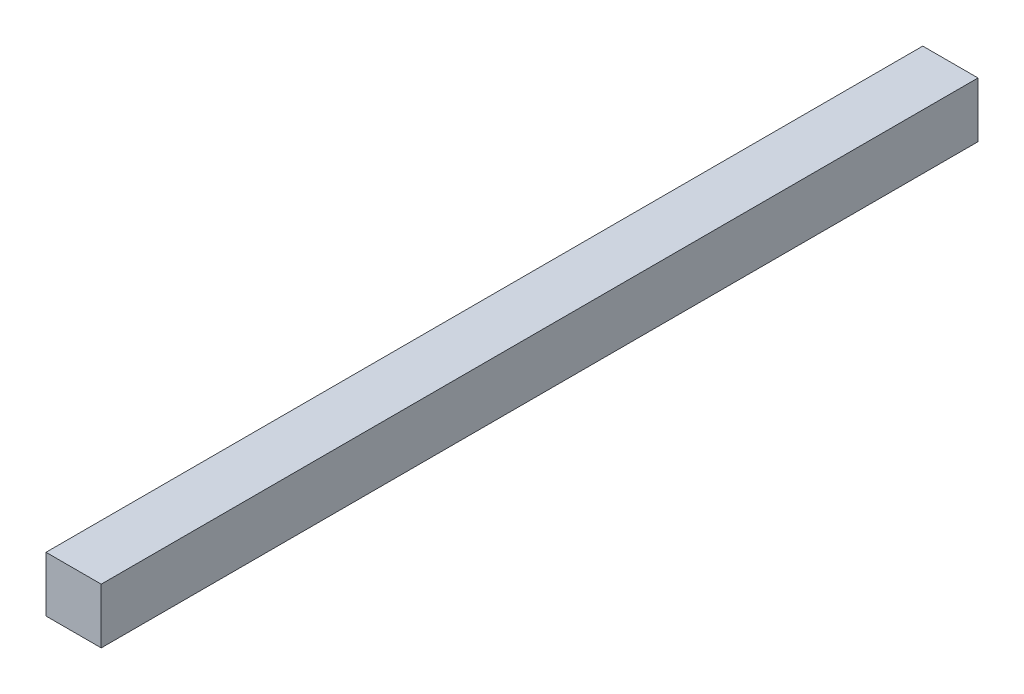
ISO-10303-21;
HEADER;
FILE_DESCRIPTION(('STEP AP214'),'2;1');
FILE_NAME('part.step','',(''),(''),'','','');
FILE_SCHEMA(('AUTOMOTIVE_DESIGN { 1 0 10303 214 1 1 1 1 }'));
ENDSEC;
DATA;
#1=APPLICATION_CONTEXT('core data for automotive mechanical design processes');
#2=APPLICATION_PROTOCOL_DEFINITION('international standard','automotive_design',2000,#1);
#3=PRODUCT_CONTEXT('',#1,'mechanical');
#4=PRODUCT('Part','Part','',(#3));
#5=PRODUCT_RELATED_PRODUCT_CATEGORY('part','',(#4));
#6=PRODUCT_DEFINITION_FORMATION('','',#4);
#7=PRODUCT_DEFINITION_CONTEXT('part definition',#1,'design');
#8=PRODUCT_DEFINITION('design','',#6,#7);
#9=PRODUCT_DEFINITION_SHAPE('','',#8);
#10=(LENGTH_UNIT() NAMED_UNIT(*) SI_UNIT(.MILLI.,.METRE.));
#11=(NAMED_UNIT(*) PLANE_ANGLE_UNIT() SI_UNIT($,.RADIAN.));
#12=(NAMED_UNIT(*) SI_UNIT($,.STERADIAN.) SOLID_ANGLE_UNIT());
#13=UNCERTAINTY_MEASURE_WITH_UNIT(LENGTH_MEASURE(1.E-05),#10,'distance_accuracy_value','');
#14=(GEOMETRIC_REPRESENTATION_CONTEXT(3) GLOBAL_UNCERTAINTY_ASSIGNED_CONTEXT((#13)) GLOBAL_UNIT_ASSIGNED_CONTEXT((#10,
#11,#12)) REPRESENTATION_CONTEXT('',''));
#15=CARTESIAN_POINT('',(0.,0.,0.));
#16=DIRECTION('',(0.,0.,1.));
#17=DIRECTION('',(1.,0.,0.));
#18=AXIS2_PLACEMENT_3D('',#15,#16,#17);
#19=CARTESIAN_POINT('',(10.16,-10.16,322.579999999999));
#20=DIRECTION('',(-1.,0.,0.));
#21=DIRECTION('',(0.,0.,1.));
#22=AXIS2_PLACEMENT_3D('',#19,#20,#21);
#23=PLANE('',#22);
#24=DIRECTION('',(0.,1.,0.));
#25=VECTOR('',#24,1.);
#26=CARTESIAN_POINT('',(10.16,-10.16,0.));
#27=LINE('',#26,#25);
#28=CARTESIAN_POINT('',(10.16,-10.16,0.));
#29=VERTEX_POINT('',#28);
#30=CARTESIAN_POINT('',(10.16,10.16,0.));
#31=VERTEX_POINT('',#30);
#32=EDGE_CURVE('E111',#29,#31,#27,.T.);
#33=ORIENTED_EDGE('',*,*,#32,.T.);
#34=DIRECTION('',(0.,0.,-1.));
#35=VECTOR('',#34,1.);
#36=CARTESIAN_POINT('',(10.16,10.16,322.579999999999));
#37=LINE('',#36,#35);
#38=CARTESIAN_POINT('',(10.16,10.16,322.579999999999));
#39=VERTEX_POINT('',#38);
#40=EDGE_CURVE('E11',#39,#31,#37,.T.);
#41=ORIENTED_EDGE('',*,*,#40,.F.);
#42=DIRECTION('',(0.,1.,0.));
#43=VECTOR('',#42,1.);
#44=CARTESIAN_POINT('',(10.16,-10.16,322.579999999999));
#45=LINE('',#44,#43);
#46=CARTESIAN_POINT('',(10.16,-10.16,322.579999999999));
#47=VERTEX_POINT('',#46);
#48=EDGE_CURVE('E95',#47,#39,#45,.T.);
#49=ORIENTED_EDGE('',*,*,#48,.F.);
#50=DIRECTION('',(0.,0.,-1.));
#51=VECTOR('',#50,1.);
#52=CARTESIAN_POINT('',(10.16,-10.16,322.579999999999));
#53=LINE('',#52,#51);
#54=EDGE_CURVE('E107',#47,#29,#53,.T.);
#55=ORIENTED_EDGE('',*,*,#54,.T.);
#56=EDGE_LOOP('',(#33,#41,#49,#55));
#57=FACE_BOUND('',#56,.T.);
#58=ADVANCED_FACE('F43',(#57),#23,.F.);
#59=CARTESIAN_POINT('',(-10.16,10.16,322.579999999999));
#60=DIRECTION('',(0.,-1.,0.));
#61=DIRECTION('',(0.,0.,-1.));
#62=AXIS2_PLACEMENT_3D('',#59,#60,#61);
#63=PLANE('',#62);
#64=DIRECTION('',(-1.,0.,0.));
#65=VECTOR('',#64,1.);
#66=CARTESIAN_POINT('',(-10.16,10.16,0.));
#67=LINE('',#66,#65);
#68=CARTESIAN_POINT('',(-10.16,10.16,0.));
#69=VERTEX_POINT('',#68);
#70=EDGE_CURVE('E100',#31,#69,#67,.T.);
#71=ORIENTED_EDGE('',*,*,#70,.T.);
#72=DIRECTION('',(0.,0.,-1.));
#73=VECTOR('',#72,1.);
#74=CARTESIAN_POINT('',(-10.16,10.16,322.579999999999));
#75=LINE('',#74,#73);
#76=CARTESIAN_POINT('',(-10.16,10.16,322.579999999999));
#77=VERTEX_POINT('',#76);
#78=EDGE_CURVE('E52',#77,#69,#75,.T.);
#79=ORIENTED_EDGE('',*,*,#78,.F.);
#80=DIRECTION('',(-1.,0.,0.));
#81=VECTOR('',#80,1.);
#82=CARTESIAN_POINT('',(-10.16,10.16,322.579999999999));
#83=LINE('',#82,#81);
#84=EDGE_CURVE('E90',#39,#77,#83,.T.);
#85=ORIENTED_EDGE('',*,*,#84,.F.);
#86=ORIENTED_EDGE('',*,*,#40,.T.);
#87=EDGE_LOOP('',(#71,#79,#85,#86));
#88=FACE_BOUND('',#87,.T.);
#89=ADVANCED_FACE('F99',(#88),#63,.F.);
#90=CARTESIAN_POINT('',(-10.16,-10.16,322.579999999999));
#91=DIRECTION('',(1.,0.,0.));
#92=DIRECTION('',(0.,0.,-1.));
#93=AXIS2_PLACEMENT_3D('',#90,#91,#92);
#94=PLANE('',#93);
#95=DIRECTION('',(0.,-1.,0.));
#96=VECTOR('',#95,1.);
#97=CARTESIAN_POINT('',(-10.16,-10.16,0.));
#98=LINE('',#97,#96);
#99=CARTESIAN_POINT('',(-10.16,-10.16,0.));
#100=VERTEX_POINT('',#99);
#101=EDGE_CURVE('E77',#69,#100,#98,.T.);
#102=ORIENTED_EDGE('',*,*,#101,.T.);
#103=DIRECTION('',(0.,0.,-1.));
#104=VECTOR('',#103,1.);
#105=CARTESIAN_POINT('',(-10.16,-10.16,322.579999999999));
#106=LINE('',#105,#104);
#107=CARTESIAN_POINT('',(-10.16,-10.16,322.579999999999));
#108=VERTEX_POINT('',#107);
#109=EDGE_CURVE('E102',#108,#100,#106,.T.);
#110=ORIENTED_EDGE('',*,*,#109,.F.);
#111=DIRECTION('',(0.,-1.,0.));
#112=VECTOR('',#111,1.);
#113=CARTESIAN_POINT('',(-10.16,-10.16,322.579999999999));
#114=LINE('',#113,#112);
#115=EDGE_CURVE('E93',#77,#108,#114,.T.);
#116=ORIENTED_EDGE('',*,*,#115,.F.);
#117=ORIENTED_EDGE('',*,*,#78,.T.);
#118=EDGE_LOOP('',(#102,#110,#116,#117));
#119=FACE_BOUND('',#118,.T.);
#120=ADVANCED_FACE('F103',(#119),#94,.F.);
#121=CARTESIAN_POINT('',(-10.16,-10.16,322.579999999999));
#122=DIRECTION('',(0.,1.,0.));
#123=DIRECTION('',(0.,0.,1.));
#124=AXIS2_PLACEMENT_3D('',#121,#122,#123);
#125=PLANE('',#124);
#126=DIRECTION('',(1.,0.,0.));
#127=VECTOR('',#126,1.);
#128=CARTESIAN_POINT('',(-10.16,-10.16,0.));
#129=LINE('',#128,#127);
#130=EDGE_CURVE('E83',#100,#29,#129,.T.);
#131=ORIENTED_EDGE('',*,*,#130,.T.);
#132=ORIENTED_EDGE('',*,*,#54,.F.);
#133=DIRECTION('',(1.,0.,0.));
#134=VECTOR('',#133,1.);
#135=CARTESIAN_POINT('',(-10.16,-10.16,322.579999999999));
#136=LINE('',#135,#134);
#137=EDGE_CURVE('E60',#108,#47,#136,.T.);
#138=ORIENTED_EDGE('',*,*,#137,.F.);
#139=ORIENTED_EDGE('',*,*,#109,.T.);
#140=EDGE_LOOP('',(#131,#132,#138,#139));
#141=FACE_BOUND('',#140,.T.);
#142=ADVANCED_FACE('F124',(#141),#125,.F.);
#143=CARTESIAN_POINT('',(0.,0.,322.579999999999));
#144=DIRECTION('',(0.,0.,-1.));
#145=DIRECTION('',(-1.,0.,0.));
#146=AXIS2_PLACEMENT_3D('',#143,#144,#145);
#147=PLANE('',#146);
#148=ORIENTED_EDGE('',*,*,#48,.T.);
#149=ORIENTED_EDGE('',*,*,#84,.T.);
#150=ORIENTED_EDGE('',*,*,#115,.T.);
#151=ORIENTED_EDGE('',*,*,#137,.T.);
#152=EDGE_LOOP('',(#148,#149,#150,#151));
#153=FACE_BOUND('',#152,.T.);
#154=ADVANCED_FACE('F91',(#153),#147,.F.);
#155=CARTESIAN_POINT('',(0.,0.,0.));
#156=DIRECTION('',(0.,0.,-1.));
#157=DIRECTION('',(-1.,0.,0.));
#158=AXIS2_PLACEMENT_3D('',#155,#156,#157);
#159=PLANE('',#158);
#160=ORIENTED_EDGE('',*,*,#32,.F.);
#161=ORIENTED_EDGE('',*,*,#130,.F.);
#162=ORIENTED_EDGE('',*,*,#101,.F.);
#163=ORIENTED_EDGE('',*,*,#70,.F.);
#164=EDGE_LOOP('',(#160,#161,#162,#163));
#165=FACE_BOUND('',#164,.T.);
#166=ADVANCED_FACE('F127',(#165),#159,.T.);
#167=CLOSED_SHELL('',(#58,#89,#120,#142,#154,#166));
#168=MANIFOLD_SOLID_BREP('B2',#167);
#169=ADVANCED_BREP_SHAPE_REPRESENTATION('',(#18,#168),#14);
#170=SHAPE_DEFINITION_REPRESENTATION(#9,#169);
ENDSEC;
END-ISO-10303-21;
